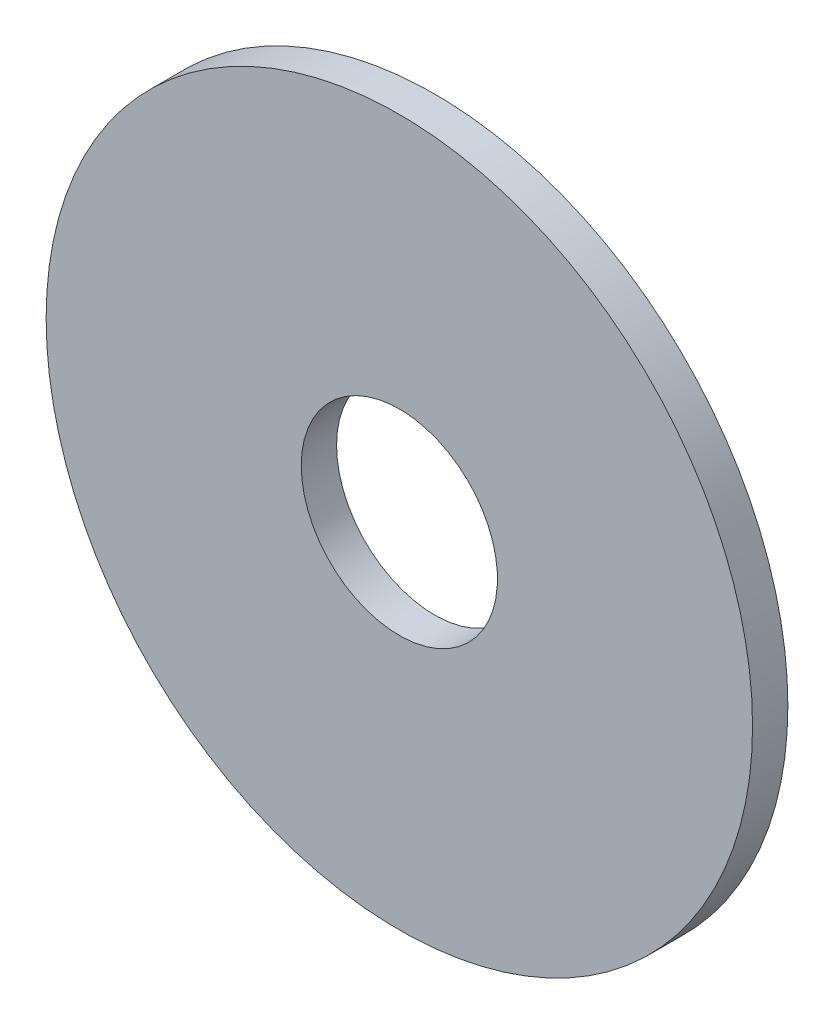
ISO-10303-21;
HEADER;
FILE_DESCRIPTION(('STEP AP214'),'2;1');
FILE_NAME('part.step','',(''),(''),'','','');
FILE_SCHEMA(('AUTOMOTIVE_DESIGN { 1 0 10303 214 1 1 1 1 }'));
ENDSEC;
DATA;
#1=APPLICATION_CONTEXT('core data for automotive mechanical design processes');
#2=APPLICATION_PROTOCOL_DEFINITION('international standard','automotive_design',2000,#1);
#3=PRODUCT_CONTEXT('',#1,'mechanical');
#4=PRODUCT('Part','Part','',(#3));
#5=PRODUCT_RELATED_PRODUCT_CATEGORY('part','',(#4));
#6=PRODUCT_DEFINITION_FORMATION('','',#4);
#7=PRODUCT_DEFINITION_CONTEXT('part definition',#1,'design');
#8=PRODUCT_DEFINITION('design','',#6,#7);
#9=PRODUCT_DEFINITION_SHAPE('','',#8);
#10=(LENGTH_UNIT() NAMED_UNIT(*) SI_UNIT(.MILLI.,.METRE.));
#11=(NAMED_UNIT(*) PLANE_ANGLE_UNIT() SI_UNIT($,.RADIAN.));
#12=(NAMED_UNIT(*) SI_UNIT($,.STERADIAN.) SOLID_ANGLE_UNIT());
#13=UNCERTAINTY_MEASURE_WITH_UNIT(LENGTH_MEASURE(1.E-05),#10,'distance_accuracy_value','');
#14=(GEOMETRIC_REPRESENTATION_CONTEXT(3) GLOBAL_UNCERTAINTY_ASSIGNED_CONTEXT((#13)) GLOBAL_UNIT_ASSIGNED_CONTEXT((#10,
#11,#12)) REPRESENTATION_CONTEXT('',''));
#15=CARTESIAN_POINT('',(0.,0.,0.));
#16=DIRECTION('',(0.,0.,1.));
#17=DIRECTION('',(1.,0.,0.));
#18=AXIS2_PLACEMENT_3D('',#15,#16,#17);
#19=CARTESIAN_POINT('',(0.,0.,6.));
#20=DIRECTION('',(0.,0.,-1.));
#21=DIRECTION('',(-1.,0.,0.));
#22=AXIS2_PLACEMENT_3D('',#19,#20,#21);
#23=CYLINDRICAL_SURFACE('',#22,60.);
#24=CARTESIAN_POINT('',(0.,0.,6.));
#25=DIRECTION('',(0.,0.,1.));
#26=DIRECTION('',(1.,0.,0.));
#27=AXIS2_PLACEMENT_3D('',#24,#25,#26);
#28=CIRCLE('',#27,60.);
#29=CARTESIAN_POINT('',(60.,0.,6.));
#30=VERTEX_POINT('',#29);
#31=EDGE_CURVE('E10',#30,#30,#28,.T.);
#32=ORIENTED_EDGE('',*,*,#31,.F.);
#33=EDGE_LOOP('',(#32));
#34=FACE_BOUND('',#33,.T.);
#35=CARTESIAN_POINT('',(0.,0.,0.));
#36=DIRECTION('',(0.,0.,1.));
#37=DIRECTION('',(1.,0.,0.));
#38=AXIS2_PLACEMENT_3D('',#35,#36,#37);
#39=CIRCLE('',#38,60.);
#40=CARTESIAN_POINT('',(60.,0.,0.));
#41=VERTEX_POINT('',#40);
#42=EDGE_CURVE('E34',#41,#41,#39,.T.);
#43=ORIENTED_EDGE('',*,*,#42,.T.);
#44=EDGE_LOOP('',(#43));
#45=FACE_BOUND('',#44,.T.);
#46=ADVANCED_FACE('F31',(#34,#45),#23,.T.);
#47=CARTESIAN_POINT('',(0.,0.,6.));
#48=DIRECTION('',(0.,0.,1.));
#49=DIRECTION('',(1.,0.,0.));
#50=AXIS2_PLACEMENT_3D('',#47,#48,#49);
#51=PLANE('',#50);
#52=CARTESIAN_POINT('',(0.,0.,6.));
#53=DIRECTION('',(0.,0.,-1.));
#54=DIRECTION('',(-1.,0.,0.));
#55=AXIS2_PLACEMENT_3D('',#52,#53,#54);
#56=CIRCLE('',#55,16.665);
#57=CARTESIAN_POINT('',(-16.665,0.,6.));
#58=VERTEX_POINT('',#57);
#59=EDGE_CURVE('E41',#58,#58,#56,.T.);
#60=ORIENTED_EDGE('',*,*,#59,.T.);
#61=EDGE_LOOP('',(#60));
#62=FACE_BOUND('',#61,.T.);
#63=ORIENTED_EDGE('',*,*,#31,.T.);
#64=EDGE_LOOP('',(#63));
#65=FACE_BOUND('',#64,.T.);
#66=ADVANCED_FACE('F49',(#62,#65),#51,.T.);
#67=CARTESIAN_POINT('',(0.,0.,0.));
#68=DIRECTION('',(0.,0.,1.));
#69=DIRECTION('',(1.,0.,0.));
#70=AXIS2_PLACEMENT_3D('',#67,#68,#69);
#71=PLANE('',#70);
#72=CARTESIAN_POINT('',(0.,0.,0.));
#73=DIRECTION('',(0.,0.,-1.));
#74=DIRECTION('',(-1.,0.,0.));
#75=AXIS2_PLACEMENT_3D('',#72,#73,#74);
#76=CIRCLE('',#75,16.665);
#77=CARTESIAN_POINT('',(-16.665,0.,0.));
#78=VERTEX_POINT('',#77);
#79=EDGE_CURVE('E43',#78,#78,#76,.T.);
#80=ORIENTED_EDGE('',*,*,#79,.F.);
#81=EDGE_LOOP('',(#80));
#82=FACE_BOUND('',#81,.T.);
#83=ORIENTED_EDGE('',*,*,#42,.F.);
#84=EDGE_LOOP('',(#83));
#85=FACE_BOUND('',#84,.T.);
#86=ADVANCED_FACE('F54',(#82,#85),#71,.F.);
#87=CARTESIAN_POINT('',(0.,0.,6.));
#88=DIRECTION('',(0.,0.,-1.));
#89=DIRECTION('',(-1.,0.,0.));
#90=AXIS2_PLACEMENT_3D('',#87,#88,#89);
#91=CYLINDRICAL_SURFACE('',#90,16.665);
#92=ORIENTED_EDGE('',*,*,#59,.F.);
#93=EDGE_LOOP('',(#92));
#94=FACE_BOUND('',#93,.T.);
#95=ORIENTED_EDGE('',*,*,#79,.T.);
#96=EDGE_LOOP('',(#95));
#97=FACE_BOUND('',#96,.T.);
#98=ADVANCED_FACE('F51',(#94,#97),#91,.F.);
#99=CLOSED_SHELL('',(#46,#66,#86,#98));
#100=MANIFOLD_SOLID_BREP('B2',#99);
#101=ADVANCED_BREP_SHAPE_REPRESENTATION('',(#18,#100),#14);
#102=SHAPE_DEFINITION_REPRESENTATION(#9,#101);
ENDSEC;
END-ISO-10303-21;
